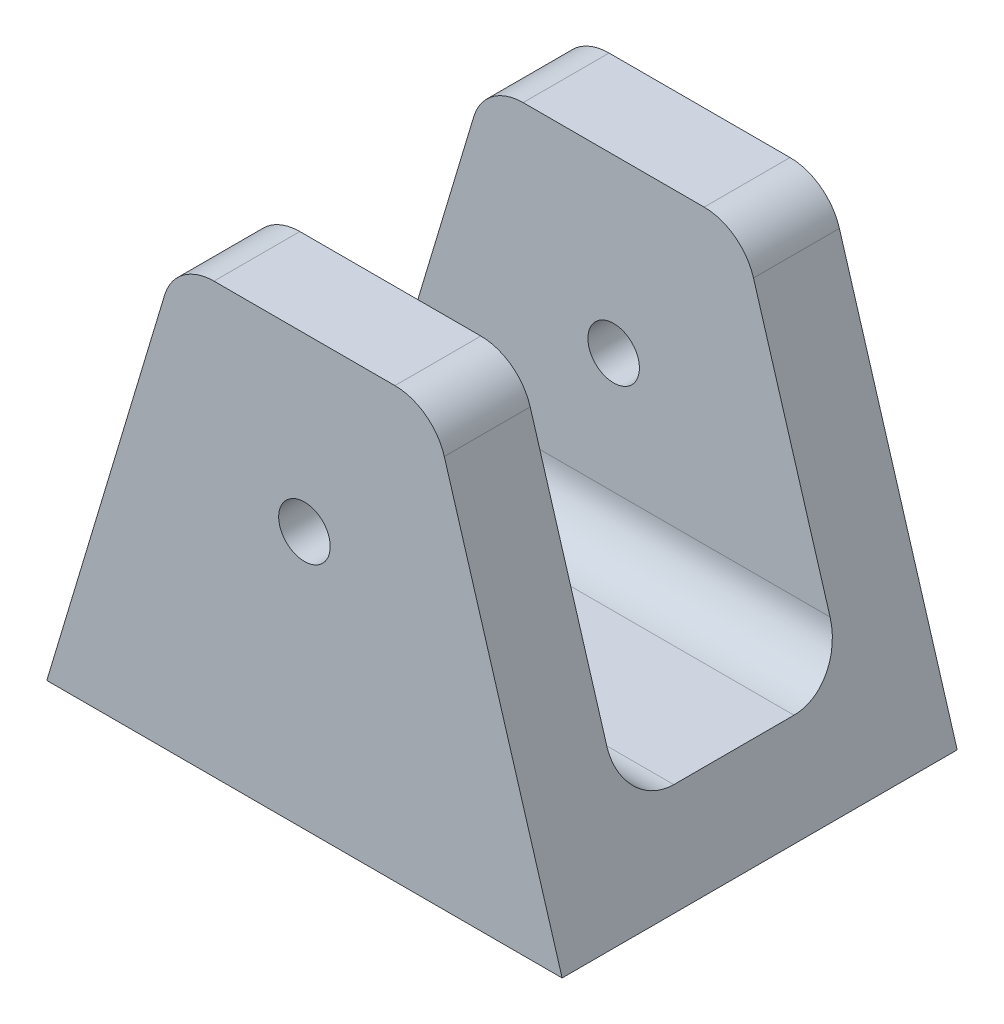
ISO-10303-21;
HEADER;
FILE_DESCRIPTION(('STEP AP214'),'2;1');
FILE_NAME('part.step','',(''),(''),'','','');
FILE_SCHEMA(('AUTOMOTIVE_DESIGN { 1 0 10303 214 1 1 1 1 }'));
ENDSEC;
DATA;
#1=APPLICATION_CONTEXT('core data for automotive mechanical design processes');
#2=APPLICATION_PROTOCOL_DEFINITION('international standard','automotive_design',2000,#1);
#3=PRODUCT_CONTEXT('',#1,'mechanical');
#4=PRODUCT('Part','Part','',(#3));
#5=PRODUCT_RELATED_PRODUCT_CATEGORY('part','',(#4));
#6=PRODUCT_DEFINITION_FORMATION('','',#4);
#7=PRODUCT_DEFINITION_CONTEXT('part definition',#1,'design');
#8=PRODUCT_DEFINITION('design','',#6,#7);
#9=PRODUCT_DEFINITION_SHAPE('','',#8);
#10=(LENGTH_UNIT() NAMED_UNIT(*) SI_UNIT(.MILLI.,.METRE.));
#11=(NAMED_UNIT(*) PLANE_ANGLE_UNIT() SI_UNIT($,.RADIAN.));
#12=(NAMED_UNIT(*) SI_UNIT($,.STERADIAN.) SOLID_ANGLE_UNIT());
#13=UNCERTAINTY_MEASURE_WITH_UNIT(LENGTH_MEASURE(1.E-05),#10,'distance_accuracy_value','');
#14=(GEOMETRIC_REPRESENTATION_CONTEXT(3) GLOBAL_UNCERTAINTY_ASSIGNED_CONTEXT((#13)) GLOBAL_UNIT_ASSIGNED_CONTEXT((#10,
#11,#12)) REPRESENTATION_CONTEXT('',''));
#15=CARTESIAN_POINT('',(0.,0.,0.));
#16=DIRECTION('',(0.,0.,1.));
#17=DIRECTION('',(1.,0.,0.));
#18=AXIS2_PLACEMENT_3D('',#15,#16,#17);
#19=CARTESIAN_POINT('',(5.26790804732683,22.,23.));
#20=DIRECTION('',(0.,0.,-1.));
#21=DIRECTION('',(-1.,0.,0.));
#22=AXIS2_PLACEMENT_3D('',#19,#20,#21);
#23=CYLINDRICAL_SURFACE('',#22,3.);
#24=DIRECTION('',(0.,0.,-1.));
#25=VECTOR('',#24,1.);
#26=CARTESIAN_POINT('',(8.14138690299029,22.862043656699,23.));
#27=LINE('',#26,#25);
#28=CARTESIAN_POINT('',(8.14138690299029,22.862043656699,23.));
#29=VERTEX_POINT('',#28);
#30=CARTESIAN_POINT('',(8.14138690299029,22.862043656699,18.));
#31=VERTEX_POINT('',#30);
#32=EDGE_CURVE('E171',#29,#31,#27,.T.);
#33=ORIENTED_EDGE('',*,*,#32,.T.);
#34=CARTESIAN_POINT('',(5.26790804732683,22.,18.));
#35=DIRECTION('',(0.,0.,1.));
#36=DIRECTION('',(1.,0.,0.));
#37=AXIS2_PLACEMENT_3D('',#34,#35,#36);
#38=CIRCLE('',#37,3.);
#39=CARTESIAN_POINT('',(5.26790804732683,25.,18.));
#40=VERTEX_POINT('',#39);
#41=EDGE_CURVE('E261',#31,#40,#38,.T.);
#42=ORIENTED_EDGE('',*,*,#41,.T.);
#43=DIRECTION('',(0.,0.,-1.));
#44=VECTOR('',#43,1.);
#45=CARTESIAN_POINT('',(5.26790804732683,25.,23.));
#46=LINE('',#45,#44);
#47=CARTESIAN_POINT('',(5.26790804732683,25.,23.));
#48=VERTEX_POINT('',#47);
#49=EDGE_CURVE('E167',#48,#40,#46,.T.);
#50=ORIENTED_EDGE('',*,*,#49,.F.);
#51=CARTESIAN_POINT('',(5.26790804732683,22.,23.));
#52=DIRECTION('',(0.,0.,1.));
#53=DIRECTION('',(-1.,0.,0.));
#54=AXIS2_PLACEMENT_3D('',#51,#52,#53);
#55=CIRCLE('',#54,3.);
#56=EDGE_CURVE('E240',#29,#48,#55,.T.);
#57=ORIENTED_EDGE('',*,*,#56,.F.);
#58=EDGE_LOOP('',(#33,#42,#50,#57));
#59=FACE_BOUND('',#58,.T.);
#60=ADVANCED_FACE('F32',(#59),#23,.T.);
#61=CARTESIAN_POINT('',(-5.26790804732683,25.,23.));
#62=DIRECTION('',(0.,-1.,0.));
#63=DIRECTION('',(0.,0.,-1.));
#64=AXIS2_PLACEMENT_3D('',#61,#62,#63);
#65=PLANE('',#64);
#66=ORIENTED_EDGE('',*,*,#49,.T.);
#67=DIRECTION('',(-1.,0.,0.));
#68=VECTOR('',#67,1.);
#69=CARTESIAN_POINT('',(-5.26790804732683,25.,18.));
#70=LINE('',#69,#68);
#71=CARTESIAN_POINT('',(-5.26790804732683,25.,18.));
#72=VERTEX_POINT('',#71);
#73=EDGE_CURVE('E264',#40,#72,#70,.T.);
#74=ORIENTED_EDGE('',*,*,#73,.T.);
#75=DIRECTION('',(0.,0.,-1.));
#76=VECTOR('',#75,1.);
#77=CARTESIAN_POINT('',(-5.26790804732683,25.,23.));
#78=LINE('',#77,#76);
#79=CARTESIAN_POINT('',(-5.26790804732683,25.,23.));
#80=VERTEX_POINT('',#79);
#81=EDGE_CURVE('E163',#80,#72,#78,.T.);
#82=ORIENTED_EDGE('',*,*,#81,.F.);
#83=DIRECTION('',(-1.,0.,0.));
#84=VECTOR('',#83,1.);
#85=CARTESIAN_POINT('',(-5.26790804732683,25.,23.));
#86=LINE('',#85,#84);
#87=EDGE_CURVE('E158',#48,#80,#86,.T.);
#88=ORIENTED_EDGE('',*,*,#87,.F.);
#89=EDGE_LOOP('',(#66,#74,#82,#88));
#90=FACE_BOUND('',#89,.T.);
#91=ADVANCED_FACE('F300',(#90),#65,.F.);
#92=CARTESIAN_POINT('',(-5.26790804732683,22.,23.));
#93=DIRECTION('',(0.,0.,-1.));
#94=DIRECTION('',(-1.,0.,0.));
#95=AXIS2_PLACEMENT_3D('',#92,#93,#94);
#96=CYLINDRICAL_SURFACE('',#95,3.);
#97=ORIENTED_EDGE('',*,*,#81,.T.);
#98=CARTESIAN_POINT('',(-5.26790804732683,22.,18.));
#99=DIRECTION('',(0.,0.,1.));
#100=DIRECTION('',(1.,0.,0.));
#101=AXIS2_PLACEMENT_3D('',#98,#99,#100);
#102=CIRCLE('',#101,3.);
#103=CARTESIAN_POINT('',(-8.14138690299029,22.862043656699,18.));
#104=VERTEX_POINT('',#103);
#105=EDGE_CURVE('E186',#72,#104,#102,.T.);
#106=ORIENTED_EDGE('',*,*,#105,.T.);
#107=DIRECTION('',(0.,0.,-1.));
#108=VECTOR('',#107,1.);
#109=CARTESIAN_POINT('',(-8.14138690299029,22.862043656699,23.));
#110=LINE('',#109,#108);
#111=CARTESIAN_POINT('',(-8.14138690299029,22.862043656699,23.));
#112=VERTEX_POINT('',#111);
#113=EDGE_CURVE('E154',#112,#104,#110,.T.);
#114=ORIENTED_EDGE('',*,*,#113,.F.);
#115=CARTESIAN_POINT('',(-5.26790804732683,22.,23.));
#116=DIRECTION('',(0.,0.,1.));
#117=DIRECTION('',(1.,0.,0.));
#118=AXIS2_PLACEMENT_3D('',#115,#116,#117);
#119=CIRCLE('',#118,3.);
#120=EDGE_CURVE('E155',#80,#112,#119,.T.);
#121=ORIENTED_EDGE('',*,*,#120,.F.);
#122=EDGE_LOOP('',(#97,#106,#114,#121));
#123=FACE_BOUND('',#122,.T.);
#124=ADVANCED_FACE('F306',(#123),#96,.T.);
#125=CARTESIAN_POINT('',(0.,15.,23.));
#126=DIRECTION('',(0.,0.,-1.));
#127=DIRECTION('',(-1.,0.,0.));
#128=AXIS2_PLACEMENT_3D('',#125,#126,#127);
#129=CYLINDRICAL_SURFACE('',#128,1.5);
#130=CARTESIAN_POINT('',(0.,15.,18.));
#131=DIRECTION('',(0.,0.,1.));
#132=DIRECTION('',(1.,0.,0.));
#133=AXIS2_PLACEMENT_3D('',#130,#131,#132);
#134=CIRCLE('',#133,1.5);
#135=CARTESIAN_POINT('',(1.5,15.,18.));
#136=VERTEX_POINT('',#135);
#137=EDGE_CURVE('E138',#136,#136,#134,.T.);
#138=ORIENTED_EDGE('',*,*,#137,.F.);
#139=EDGE_LOOP('',(#138));
#140=FACE_BOUND('',#139,.T.);
#141=CARTESIAN_POINT('',(0.,15.,23.));
#142=DIRECTION('',(0.,0.,1.));
#143=DIRECTION('',(1.,0.,0.));
#144=AXIS2_PLACEMENT_3D('',#141,#142,#143);
#145=CIRCLE('',#144,1.5);
#146=CARTESIAN_POINT('',(1.5,15.,23.));
#147=VERTEX_POINT('',#146);
#148=EDGE_CURVE('E237',#147,#147,#145,.T.);
#149=ORIENTED_EDGE('',*,*,#148,.T.);
#150=EDGE_LOOP('',(#149));
#151=FACE_BOUND('',#150,.T.);
#152=ADVANCED_FACE('F297',(#140,#151),#129,.F.);
#153=CARTESIAN_POINT('',(-5.26790804732683,22.,23.));
#154=DIRECTION('',(0.,0.,1.));
#155=DIRECTION('',(1.,0.,0.));
#156=AXIS2_PLACEMENT_3D('',#153,#154,#155);
#157=PLANE('',#156);
#158=DIRECTION('',(-0.287347885566345,-0.957826285221151,0.));
#159=VECTOR('',#158,1.);
#160=CARTESIAN_POINT('',(-15.,0.,23.));
#161=LINE('',#160,#159);
#162=CARTESIAN_POINT('',(-15.,0.,23.));
#163=VERTEX_POINT('',#162);
#164=EDGE_CURVE('E246',#112,#163,#161,.T.);
#165=ORIENTED_EDGE('',*,*,#164,.T.);
#166=DIRECTION('',(1.,0.,0.));
#167=VECTOR('',#166,1.);
#168=CARTESIAN_POINT('',(-15.,0.,23.));
#169=LINE('',#168,#167);
#170=CARTESIAN_POINT('',(15.,0.,23.));
#171=VERTEX_POINT('',#170);
#172=EDGE_CURVE('E244',#163,#171,#169,.T.);
#173=ORIENTED_EDGE('',*,*,#172,.T.);
#174=DIRECTION('',(-0.287347885566346,0.957826285221151,0.));
#175=VECTOR('',#174,1.);
#176=CARTESIAN_POINT('',(8.14138690299029,22.862043656699,23.));
#177=LINE('',#176,#175);
#178=EDGE_CURVE('E242',#171,#29,#177,.T.);
#179=ORIENTED_EDGE('',*,*,#178,.T.);
#180=ORIENTED_EDGE('',*,*,#56,.T.);
#181=ORIENTED_EDGE('',*,*,#87,.T.);
#182=ORIENTED_EDGE('',*,*,#120,.T.);
#183=EDGE_LOOP('',(#165,#173,#179,#180,#181,#182));
#184=FACE_BOUND('',#183,.T.);
#185=ORIENTED_EDGE('',*,*,#148,.F.);
#186=EDGE_LOOP('',(#185));
#187=FACE_BOUND('',#186,.T.);
#188=ADVANCED_FACE('F346',(#184,#187),#157,.T.);
#189=CARTESIAN_POINT('',(-5.26790804732683,22.,0.));
#190=DIRECTION('',(0.,0.,1.));
#191=DIRECTION('',(1.,0.,0.));
#192=AXIS2_PLACEMENT_3D('',#189,#190,#191);
#193=PLANE('',#192);
#194=DIRECTION('',(-0.287347885566345,-0.957826285221151,0.));
#195=VECTOR('',#194,1.);
#196=CARTESIAN_POINT('',(-15.,0.,0.));
#197=LINE('',#196,#195);
#198=CARTESIAN_POINT('',(-8.14138690299029,22.862043656699,0.));
#199=VERTEX_POINT('',#198);
#200=CARTESIAN_POINT('',(-15.,0.,0.));
#201=VERTEX_POINT('',#200);
#202=EDGE_CURVE('E236',#199,#201,#197,.T.);
#203=ORIENTED_EDGE('',*,*,#202,.F.);
#204=CARTESIAN_POINT('',(-5.26790804732683,22.,0.));
#205=DIRECTION('',(0.,0.,1.));
#206=DIRECTION('',(1.,0.,0.));
#207=AXIS2_PLACEMENT_3D('',#204,#205,#206);
#208=CIRCLE('',#207,3.);
#209=CARTESIAN_POINT('',(-5.26790804732683,25.,0.));
#210=VERTEX_POINT('',#209);
#211=EDGE_CURVE('E152',#210,#199,#208,.T.);
#212=ORIENTED_EDGE('',*,*,#211,.F.);
#213=DIRECTION('',(-1.,0.,0.));
#214=VECTOR('',#213,1.);
#215=CARTESIAN_POINT('',(-5.26790804732683,25.,0.));
#216=LINE('',#215,#214);
#217=CARTESIAN_POINT('',(5.26790804732683,25.,0.));
#218=VERTEX_POINT('',#217);
#219=EDGE_CURVE('E232',#218,#210,#216,.T.);
#220=ORIENTED_EDGE('',*,*,#219,.F.);
#221=CARTESIAN_POINT('',(5.26790804732683,22.,0.));
#222=DIRECTION('',(0.,0.,1.));
#223=DIRECTION('',(-1.,0.,0.));
#224=AXIS2_PLACEMENT_3D('',#221,#222,#223);
#225=CIRCLE('',#224,3.);
#226=CARTESIAN_POINT('',(8.14138690299029,22.862043656699,0.));
#227=VERTEX_POINT('',#226);
#228=EDGE_CURVE('E225',#227,#218,#225,.T.);
#229=ORIENTED_EDGE('',*,*,#228,.F.);
#230=DIRECTION('',(-0.287347885566346,0.957826285221151,0.));
#231=VECTOR('',#230,1.);
#232=CARTESIAN_POINT('',(8.14138690299029,22.862043656699,0.));
#233=LINE('',#232,#231);
#234=CARTESIAN_POINT('',(15.,0.,0.));
#235=VERTEX_POINT('',#234);
#236=EDGE_CURVE('E220',#235,#227,#233,.T.);
#237=ORIENTED_EDGE('',*,*,#236,.F.);
#238=DIRECTION('',(1.,0.,0.));
#239=VECTOR('',#238,1.);
#240=CARTESIAN_POINT('',(-15.,0.,0.));
#241=LINE('',#240,#239);
#242=EDGE_CURVE('E226',#201,#235,#241,.T.);
#243=ORIENTED_EDGE('',*,*,#242,.F.);
#244=EDGE_LOOP('',(#203,#212,#220,#229,#237,#243));
#245=FACE_BOUND('',#244,.T.);
#246=CARTESIAN_POINT('',(0.,15.,0.));
#247=DIRECTION('',(0.,0.,1.));
#248=DIRECTION('',(1.,0.,0.));
#249=AXIS2_PLACEMENT_3D('',#246,#247,#248);
#250=CIRCLE('',#249,1.5);
#251=CARTESIAN_POINT('',(1.5,15.,0.));
#252=VERTEX_POINT('',#251);
#253=EDGE_CURVE('E249',#252,#252,#250,.T.);
#254=ORIENTED_EDGE('',*,*,#253,.T.);
#255=EDGE_LOOP('',(#254));
#256=FACE_BOUND('',#255,.T.);
#257=ADVANCED_FACE('F229',(#245,#256),#193,.F.);
#258=CARTESIAN_POINT('',(-15.,0.,23.));
#259=DIRECTION('',(0.957826285221151,-0.287347885566346,0.));
#260=DIRECTION('',(0.287347885566346,0.957826285221151,0.));
#261=AXIS2_PLACEMENT_3D('',#258,#259,#260);
#262=PLANE('',#261);
#263=ORIENTED_EDGE('',*,*,#113,.T.);
#264=DIRECTION('',(-0.287347885566346,-0.957826285221151,0.));
#265=VECTOR('',#264,1.);
#266=CARTESIAN_POINT('',(-15.,0.,18.));
#267=LINE('',#266,#265);
#268=CARTESIAN_POINT('',(-12.6,8.00000000000001,18.));
#269=VERTEX_POINT('',#268);
#270=EDGE_CURVE('E256',#104,#269,#267,.T.);
#271=ORIENTED_EDGE('',*,*,#270,.T.);
#272=CARTESIAN_POINT('',(-12.6,8.00000000000001,15.));
#273=DIRECTION('',(0.957826285221151,-0.287347885566346,0.));
#274=DIRECTION('',(-0.287347885566346,-0.957826285221151,0.));
#275=AXIS2_PLACEMENT_3D('',#272,#273,#274);
#276=ELLIPSE('',#275,3.13209195267316,3.);
#277=CARTESIAN_POINT('',(-13.5,5.00000000000001,15.));
#278=VERTEX_POINT('',#277);
#279=EDGE_CURVE('E200',#269,#278,#276,.T.);
#280=ORIENTED_EDGE('',*,*,#279,.T.);
#281=DIRECTION('',(0.,0.,-1.));
#282=VECTOR('',#281,1.);
#283=CARTESIAN_POINT('',(-13.5,5.00000000000001,23.));
#284=LINE('',#283,#282);
#285=CARTESIAN_POINT('',(-13.5,5.00000000000001,8.));
#286=VERTEX_POINT('',#285);
#287=EDGE_CURVE('E252',#278,#286,#284,.T.);
#288=ORIENTED_EDGE('',*,*,#287,.T.);
#289=CARTESIAN_POINT('',(-12.6,8.00000000000001,8.));
#290=DIRECTION('',(0.957826285221151,-0.287347885566346,0.));
#291=DIRECTION('',(-0.287347885566346,-0.957826285221151,0.));
#292=AXIS2_PLACEMENT_3D('',#289,#290,#291);
#293=ELLIPSE('',#292,3.13209195267316,3.);
#294=CARTESIAN_POINT('',(-12.6,8.00000000000001,5.));
#295=VERTEX_POINT('',#294);
#296=EDGE_CURVE('E11',#286,#295,#293,.T.);
#297=ORIENTED_EDGE('',*,*,#296,.T.);
#298=DIRECTION('',(0.287347885566346,0.957826285221151,0.));
#299=VECTOR('',#298,1.);
#300=CARTESIAN_POINT('',(-15.,0.,5.));
#301=LINE('',#300,#299);
#302=CARTESIAN_POINT('',(-8.14138690299029,22.862043656699,5.));
#303=VERTEX_POINT('',#302);
#304=EDGE_CURVE('E129',#295,#303,#301,.T.);
#305=ORIENTED_EDGE('',*,*,#304,.T.);
#306=EDGE_CURVE('E135',#303,#199,#110,.T.);
#307=ORIENTED_EDGE('',*,*,#306,.T.);
#308=ORIENTED_EDGE('',*,*,#202,.T.);
#309=DIRECTION('',(0.,0.,-1.));
#310=VECTOR('',#309,1.);
#311=CARTESIAN_POINT('',(-15.,0.,23.));
#312=LINE('',#311,#310);
#313=EDGE_CURVE('E177',#163,#201,#312,.T.);
#314=ORIENTED_EDGE('',*,*,#313,.F.);
#315=ORIENTED_EDGE('',*,*,#164,.F.);
#316=EDGE_LOOP('',(#263,#271,#280,#288,#297,#305,#307,#308,#314,#315));
#317=FACE_BOUND('',#316,.T.);
#318=ADVANCED_FACE('F132',(#317),#262,.F.);
#319=CARTESIAN_POINT('',(-15.,0.,23.));
#320=DIRECTION('',(0.,1.,0.));
#321=DIRECTION('',(-1.,0.,0.));
#322=AXIS2_PLACEMENT_3D('',#319,#320,#321);
#323=PLANE('',#322);
#324=CARTESIAN_POINT('',(0.,0.,11.5));
#325=DIRECTION('',(0.,1.,0.));
#326=DIRECTION('',(0.,0.,1.));
#327=AXIS2_PLACEMENT_3D('',#324,#325,#326);
#328=CIRCLE('',#327,1.5);
#329=CARTESIAN_POINT('',(0.,0.,13.));
#330=VERTEX_POINT('',#329);
#331=EDGE_CURVE('E183',#330,#330,#328,.T.);
#332=ORIENTED_EDGE('',*,*,#331,.T.);
#333=EDGE_LOOP('',(#332));
#334=FACE_BOUND('',#333,.T.);
#335=ORIENTED_EDGE('',*,*,#242,.T.);
#336=DIRECTION('',(0.,0.,-1.));
#337=VECTOR('',#336,1.);
#338=CARTESIAN_POINT('',(15.,0.,23.));
#339=LINE('',#338,#337);
#340=EDGE_CURVE('E174',#171,#235,#339,.T.);
#341=ORIENTED_EDGE('',*,*,#340,.F.);
#342=ORIENTED_EDGE('',*,*,#172,.F.);
#343=ORIENTED_EDGE('',*,*,#313,.T.);
#344=EDGE_LOOP('',(#335,#341,#342,#343));
#345=FACE_BOUND('',#344,.T.);
#346=ADVANCED_FACE('F276',(#334,#345),#323,.F.);
#347=CARTESIAN_POINT('',(8.14138690299029,22.862043656699,23.));
#348=DIRECTION('',(-0.957826285221151,-0.287347885566346,0.));
#349=DIRECTION('',(0.287347885566346,-0.957826285221152,0.));
#350=AXIS2_PLACEMENT_3D('',#347,#348,#349);
#351=PLANE('',#350);
#352=DIRECTION('',(0.287347885566346,-0.957826285221152,0.));
#353=VECTOR('',#352,1.);
#354=CARTESIAN_POINT('',(8.14138690299029,22.862043656699,5.));
#355=LINE('',#354,#353);
#356=CARTESIAN_POINT('',(8.14138690299029,22.862043656699,5.));
#357=VERTEX_POINT('',#356);
#358=CARTESIAN_POINT('',(12.6,8.00000000000001,5.));
#359=VERTEX_POINT('',#358);
#360=EDGE_CURVE('E139',#357,#359,#355,.T.);
#361=ORIENTED_EDGE('',*,*,#360,.T.);
#362=CARTESIAN_POINT('',(12.6,8.00000000000001,8.));
#363=DIRECTION('',(-0.957826285221151,-0.287347885566346,0.));
#364=DIRECTION('',(-0.287347885566346,0.957826285221152,0.));
#365=AXIS2_PLACEMENT_3D('',#362,#363,#364);
#366=ELLIPSE('',#365,3.13209195267317,3.);
#367=CARTESIAN_POINT('',(13.5,5.00000000000001,8.));
#368=VERTEX_POINT('',#367);
#369=EDGE_CURVE('E40',#359,#368,#366,.T.);
#370=ORIENTED_EDGE('',*,*,#369,.T.);
#371=DIRECTION('',(0.,0.,1.));
#372=VECTOR('',#371,1.);
#373=CARTESIAN_POINT('',(13.5,5.00000000000001,23.));
#374=LINE('',#373,#372);
#375=CARTESIAN_POINT('',(13.5,5.00000000000001,15.));
#376=VERTEX_POINT('',#375);
#377=EDGE_CURVE('E180',#368,#376,#374,.T.);
#378=ORIENTED_EDGE('',*,*,#377,.T.);
#379=CARTESIAN_POINT('',(12.6,8.00000000000001,15.));
#380=DIRECTION('',(-0.957826285221151,-0.287347885566346,0.));
#381=DIRECTION('',(-0.287347885566346,0.957826285221152,0.));
#382=AXIS2_PLACEMENT_3D('',#379,#380,#381);
#383=ELLIPSE('',#382,3.13209195267317,3.);
#384=CARTESIAN_POINT('',(12.6,8.00000000000001,18.));
#385=VERTEX_POINT('',#384);
#386=EDGE_CURVE('E198',#376,#385,#383,.T.);
#387=ORIENTED_EDGE('',*,*,#386,.T.);
#388=DIRECTION('',(-0.287347885566346,0.957826285221152,0.));
#389=VECTOR('',#388,1.);
#390=CARTESIAN_POINT('',(8.14138690299029,22.862043656699,18.));
#391=LINE('',#390,#389);
#392=EDGE_CURVE('E259',#385,#31,#391,.T.);
#393=ORIENTED_EDGE('',*,*,#392,.T.);
#394=ORIENTED_EDGE('',*,*,#32,.F.);
#395=ORIENTED_EDGE('',*,*,#178,.F.);
#396=ORIENTED_EDGE('',*,*,#340,.T.);
#397=ORIENTED_EDGE('',*,*,#236,.T.);
#398=EDGE_CURVE('E170',#357,#227,#27,.T.);
#399=ORIENTED_EDGE('',*,*,#398,.F.);
#400=EDGE_LOOP('',(#361,#370,#378,#387,#393,#394,#395,#396,#397,#399));
#401=FACE_BOUND('',#400,.T.);
#402=ADVANCED_FACE('F204',(#401),#351,.F.);
#403=CARTESIAN_POINT('',(5.26790804732683,25.,5.));
#404=VERTEX_POINT('',#403);
#405=EDGE_CURVE('E166',#404,#218,#46,.T.);
#406=ORIENTED_EDGE('',*,*,#405,.F.);
#407=CARTESIAN_POINT('',(5.26790804732683,22.,5.));
#408=DIRECTION('',(0.,0.,-1.));
#409=DIRECTION('',(-1.,0.,0.));
#410=AXIS2_PLACEMENT_3D('',#407,#408,#409);
#411=CIRCLE('',#410,3.);
#412=EDGE_CURVE('E211',#404,#357,#411,.T.);
#413=ORIENTED_EDGE('',*,*,#412,.T.);
#414=ORIENTED_EDGE('',*,*,#398,.T.);
#415=ORIENTED_EDGE('',*,*,#228,.T.);
#416=EDGE_LOOP('',(#406,#413,#414,#415));
#417=FACE_BOUND('',#416,.T.);
#418=ADVANCED_FACE('F215',(#417),#23,.T.);
#419=CARTESIAN_POINT('',(-5.26790804732683,25.,5.));
#420=VERTEX_POINT('',#419);
#421=EDGE_CURVE('E157',#420,#210,#78,.T.);
#422=ORIENTED_EDGE('',*,*,#421,.F.);
#423=DIRECTION('',(1.,0.,0.));
#424=VECTOR('',#423,1.);
#425=CARTESIAN_POINT('',(-5.26790804732683,25.,5.));
#426=LINE('',#425,#424);
#427=EDGE_CURVE('E145',#420,#404,#426,.T.);
#428=ORIENTED_EDGE('',*,*,#427,.T.);
#429=ORIENTED_EDGE('',*,*,#405,.T.);
#430=ORIENTED_EDGE('',*,*,#219,.T.);
#431=EDGE_LOOP('',(#422,#428,#429,#430));
#432=FACE_BOUND('',#431,.T.);
#433=ADVANCED_FACE('F309',(#432),#65,.F.);
#434=ORIENTED_EDGE('',*,*,#306,.F.);
#435=CARTESIAN_POINT('',(-5.26790804732683,22.,5.));
#436=DIRECTION('',(0.,0.,-1.));
#437=DIRECTION('',(-1.,0.,0.));
#438=AXIS2_PLACEMENT_3D('',#435,#436,#437);
#439=CIRCLE('',#438,3.);
#440=EDGE_CURVE('E142',#303,#420,#439,.T.);
#441=ORIENTED_EDGE('',*,*,#440,.T.);
#442=ORIENTED_EDGE('',*,*,#421,.T.);
#443=ORIENTED_EDGE('',*,*,#211,.T.);
#444=EDGE_LOOP('',(#434,#441,#442,#443));
#445=FACE_BOUND('',#444,.T.);
#446=ADVANCED_FACE('F150',(#445),#96,.T.);
#447=CARTESIAN_POINT('',(0.,15.,5.));
#448=DIRECTION('',(0.,0.,-1.));
#449=DIRECTION('',(-1.,0.,0.));
#450=AXIS2_PLACEMENT_3D('',#447,#448,#449);
#451=CIRCLE('',#450,1.5);
#452=CARTESIAN_POINT('',(-1.5,15.,5.));
#453=VERTEX_POINT('',#452);
#454=EDGE_CURVE('E148',#453,#453,#451,.T.);
#455=ORIENTED_EDGE('',*,*,#454,.F.);
#456=EDGE_LOOP('',(#455));
#457=FACE_BOUND('',#456,.T.);
#458=ORIENTED_EDGE('',*,*,#253,.F.);
#459=EDGE_LOOP('',(#458));
#460=FACE_BOUND('',#459,.T.);
#461=ADVANCED_FACE('F287',(#457,#460),#129,.F.);
#462=CARTESIAN_POINT('',(-15.,5.00000000000001,18.));
#463=DIRECTION('',(0.,-1.,0.));
#464=DIRECTION('',(0.,0.,-1.));
#465=AXIS2_PLACEMENT_3D('',#462,#463,#464);
#466=PLANE('',#465);
#467=CARTESIAN_POINT('',(0.,5.00000000000001,11.5));
#468=DIRECTION('',(0.,1.,0.));
#469=DIRECTION('',(0.,0.,1.));
#470=AXIS2_PLACEMENT_3D('',#467,#468,#469);
#471=CIRCLE('',#470,1.5);
#472=CARTESIAN_POINT('',(0.,5.00000000000001,13.));
#473=VERTEX_POINT('',#472);
#474=EDGE_CURVE('E270',#473,#473,#471,.T.);
#475=ORIENTED_EDGE('',*,*,#474,.F.);
#476=EDGE_LOOP('',(#475));
#477=FACE_BOUND('',#476,.T.);
#478=ORIENTED_EDGE('',*,*,#287,.F.);
#479=DIRECTION('',(1.,0.,0.));
#480=VECTOR('',#479,1.);
#481=CARTESIAN_POINT('',(13.5,5.00000000000001,15.));
#482=LINE('',#481,#480);
#483=EDGE_CURVE('E191',#278,#376,#482,.T.);
#484=ORIENTED_EDGE('',*,*,#483,.T.);
#485=ORIENTED_EDGE('',*,*,#377,.F.);
#486=DIRECTION('',(1.,0.,0.));
#487=VECTOR('',#486,1.);
#488=CARTESIAN_POINT('',(-13.5,5.00000000000001,8.));
#489=LINE('',#488,#487);
#490=EDGE_CURVE('E189',#368,#286,#489,.F.);
#491=ORIENTED_EDGE('',*,*,#490,.T.);
#492=EDGE_LOOP('',(#478,#484,#485,#491));
#493=FACE_BOUND('',#492,.T.);
#494=ADVANCED_FACE('F208',(#477,#493),#466,.F.);
#495=CARTESIAN_POINT('',(-15.,5.00000000000001,18.));
#496=DIRECTION('',(0.,0.,1.));
#497=DIRECTION('',(1.,0.,0.));
#498=AXIS2_PLACEMENT_3D('',#495,#496,#497);
#499=PLANE('',#498);
#500=ORIENTED_EDGE('',*,*,#137,.T.);
#501=EDGE_LOOP('',(#500));
#502=FACE_BOUND('',#501,.T.);
#503=ORIENTED_EDGE('',*,*,#392,.F.);
#504=DIRECTION('',(1.,0.,0.));
#505=VECTOR('',#504,1.);
#506=CARTESIAN_POINT('',(-13.5,8.00000000000001,18.));
#507=LINE('',#506,#505);
#508=EDGE_CURVE('E194',#385,#269,#507,.F.);
#509=ORIENTED_EDGE('',*,*,#508,.T.);
#510=ORIENTED_EDGE('',*,*,#270,.F.);
#511=ORIENTED_EDGE('',*,*,#105,.F.);
#512=ORIENTED_EDGE('',*,*,#73,.F.);
#513=ORIENTED_EDGE('',*,*,#41,.F.);
#514=EDGE_LOOP('',(#503,#509,#510,#511,#512,#513));
#515=FACE_BOUND('',#514,.T.);
#516=ADVANCED_FACE('F286',(#502,#515),#499,.F.);
#517=CARTESIAN_POINT('',(-15.,5.00000000000001,5.));
#518=DIRECTION('',(0.,0.,-1.));
#519=DIRECTION('',(-1.,0.,0.));
#520=AXIS2_PLACEMENT_3D('',#517,#518,#519);
#521=PLANE('',#520);
#522=ORIENTED_EDGE('',*,*,#454,.T.);
#523=EDGE_LOOP('',(#522));
#524=FACE_BOUND('',#523,.T.);
#525=ORIENTED_EDGE('',*,*,#304,.F.);
#526=DIRECTION('',(1.,0.,0.));
#527=VECTOR('',#526,1.);
#528=CARTESIAN_POINT('',(13.5,8.00000000000001,5.));
#529=LINE('',#528,#527);
#530=EDGE_CURVE('E196',#295,#359,#529,.T.);
#531=ORIENTED_EDGE('',*,*,#530,.T.);
#532=ORIENTED_EDGE('',*,*,#360,.F.);
#533=ORIENTED_EDGE('',*,*,#412,.F.);
#534=ORIENTED_EDGE('',*,*,#427,.F.);
#535=ORIENTED_EDGE('',*,*,#440,.F.);
#536=EDGE_LOOP('',(#525,#531,#532,#533,#534,#535));
#537=FACE_BOUND('',#536,.T.);
#538=ADVANCED_FACE('F143',(#524,#537),#521,.F.);
#539=CARTESIAN_POINT('',(-15.,8.00000000000001,15.));
#540=DIRECTION('',(-1.,0.,0.));
#541=DIRECTION('',(0.,0.,1.));
#542=AXIS2_PLACEMENT_3D('',#539,#540,#541);
#543=CYLINDRICAL_SURFACE('',#542,3.);
#544=ORIENTED_EDGE('',*,*,#279,.F.);
#545=ORIENTED_EDGE('',*,*,#508,.F.);
#546=ORIENTED_EDGE('',*,*,#386,.F.);
#547=ORIENTED_EDGE('',*,*,#483,.F.);
#548=EDGE_LOOP('',(#544,#545,#546,#547));
#549=FACE_BOUND('',#548,.T.);
#550=ADVANCED_FACE('F323',(#549),#543,.F.);
#551=CARTESIAN_POINT('',(-15.,8.00000000000001,8.));
#552=DIRECTION('',(-1.,0.,0.));
#553=DIRECTION('',(0.,0.,1.));
#554=AXIS2_PLACEMENT_3D('',#551,#552,#553);
#555=CYLINDRICAL_SURFACE('',#554,3.);
#556=ORIENTED_EDGE('',*,*,#296,.F.);
#557=ORIENTED_EDGE('',*,*,#490,.F.);
#558=ORIENTED_EDGE('',*,*,#369,.F.);
#559=ORIENTED_EDGE('',*,*,#530,.F.);
#560=EDGE_LOOP('',(#556,#557,#558,#559));
#561=FACE_BOUND('',#560,.T.);
#562=ADVANCED_FACE('F34',(#561),#555,.F.);
#563=CARTESIAN_POINT('',(0.,0.,11.5));
#564=DIRECTION('',(0.,1.,0.));
#565=DIRECTION('',(0.,0.,1.));
#566=AXIS2_PLACEMENT_3D('',#563,#564,#565);
#567=CYLINDRICAL_SURFACE('',#566,1.5);
#568=ORIENTED_EDGE('',*,*,#331,.F.);
#569=EDGE_LOOP('',(#568));
#570=FACE_BOUND('',#569,.T.);
#571=ORIENTED_EDGE('',*,*,#474,.T.);
#572=EDGE_LOOP('',(#571));
#573=FACE_BOUND('',#572,.T.);
#574=ADVANCED_FACE('F279',(#570,#573),#567,.F.);
#575=CLOSED_SHELL('',(#60,#91,#124,#152,#188,#257,#318,#346,#402,#418,#433,#446,#461,#494,#516,
#538,#550,#562,#574));
#576=MANIFOLD_SOLID_BREP('B2',#575);
#577=ADVANCED_BREP_SHAPE_REPRESENTATION('',(#18,#576),#14);
#578=SHAPE_DEFINITION_REPRESENTATION(#9,#577);
ENDSEC;
END-ISO-10303-21;
